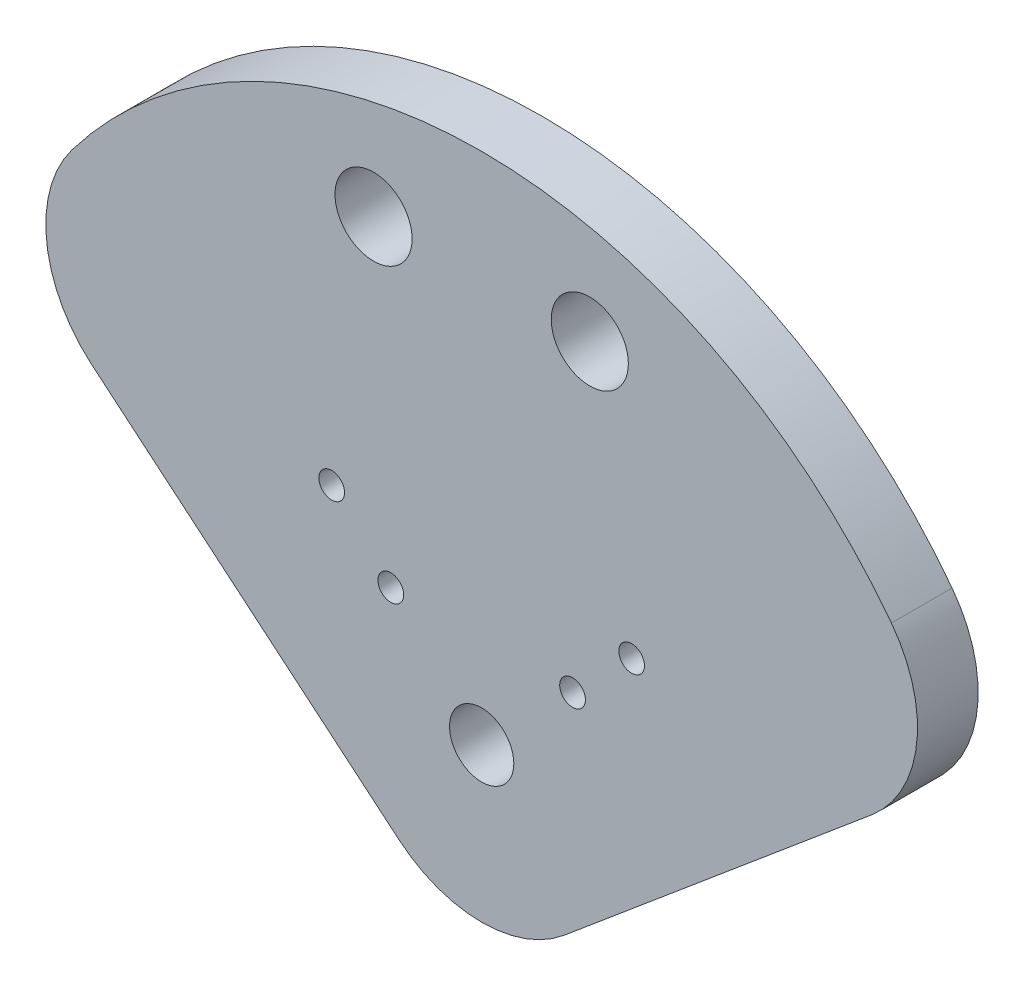
ISO-10303-21;
HEADER;
FILE_DESCRIPTION(('STEP AP214'),'2;1');
FILE_NAME('part.step','',(''),(''),'','','');
FILE_SCHEMA(('AUTOMOTIVE_DESIGN { 1 0 10303 214 1 1 1 1 }'));
ENDSEC;
DATA;
#1=APPLICATION_CONTEXT('core data for automotive mechanical design processes');
#2=APPLICATION_PROTOCOL_DEFINITION('international standard','automotive_design',2000,#1);
#3=PRODUCT_CONTEXT('',#1,'mechanical');
#4=PRODUCT('Part','Part','',(#3));
#5=PRODUCT_RELATED_PRODUCT_CATEGORY('part','',(#4));
#6=PRODUCT_DEFINITION_FORMATION('','',#4);
#7=PRODUCT_DEFINITION_CONTEXT('part definition',#1,'design');
#8=PRODUCT_DEFINITION('design','',#6,#7);
#9=PRODUCT_DEFINITION_SHAPE('','',#8);
#10=(LENGTH_UNIT() NAMED_UNIT(*) SI_UNIT(.MILLI.,.METRE.));
#11=(NAMED_UNIT(*) PLANE_ANGLE_UNIT() SI_UNIT($,.RADIAN.));
#12=(NAMED_UNIT(*) SI_UNIT($,.STERADIAN.) SOLID_ANGLE_UNIT());
#13=UNCERTAINTY_MEASURE_WITH_UNIT(LENGTH_MEASURE(1.E-05),#10,'distance_accuracy_value','');
#14=(GEOMETRIC_REPRESENTATION_CONTEXT(3) GLOBAL_UNCERTAINTY_ASSIGNED_CONTEXT((#13)) GLOBAL_UNIT_ASSIGNED_CONTEXT((#10,
#11,#12)) REPRESENTATION_CONTEXT('',''));
#15=CARTESIAN_POINT('',(0.,0.,0.));
#16=DIRECTION('',(0.,0.,1.));
#17=DIRECTION('',(1.,0.,0.));
#18=AXIS2_PLACEMENT_3D('',#15,#16,#17);
#19=CARTESIAN_POINT('',(0.,0.,5.9944));
#20=DIRECTION('',(0.,0.,1.));
#21=DIRECTION('',(1.,0.,0.));
#22=AXIS2_PLACEMENT_3D('',#19,#20,#21);
#23=PLANE('',#22);
#24=CARTESIAN_POINT('',(14.8174225997641,14.8174225997641,5.9944));
#25=DIRECTION('',(0.,0.,1.));
#26=DIRECTION('',(1.,0.,0.));
#27=AXIS2_PLACEMENT_3D('',#24,#25,#26);
#28=CIRCLE('',#27,1.27);
#29=CARTESIAN_POINT('',(16.0874225997641,14.8174225997641,5.9944));
#30=VERTEX_POINT('',#29);
#31=EDGE_CURVE('E175',#30,#30,#28,.T.);
#32=ORIENTED_EDGE('',*,*,#31,.F.);
#33=EDGE_LOOP('',(#32));
#34=FACE_BOUND('',#33,.T.);
#35=CARTESIAN_POINT('',(-8.98025612106911,8.9802561210692,5.9944));
#36=DIRECTION('',(0.,0.,1.));
#37=DIRECTION('',(1.,0.,0.));
#38=AXIS2_PLACEMENT_3D('',#35,#36,#37);
#39=CIRCLE('',#38,1.27);
#40=CARTESIAN_POINT('',(-7.71025612106911,8.9802561210692,5.9944));
#41=VERTEX_POINT('',#40);
#42=EDGE_CURVE('E163',#41,#41,#39,.T.);
#43=ORIENTED_EDGE('',*,*,#42,.F.);
#44=EDGE_LOOP('',(#43));
#45=FACE_BOUND('',#44,.T.);
#46=CARTESIAN_POINT('',(10.6827560866066,39.8685884800813,5.9944));
#47=DIRECTION('',(0.,0.,1.));
#48=DIRECTION('',(1.,0.,0.));
#49=AXIS2_PLACEMENT_3D('',#46,#47,#48);
#50=CIRCLE('',#49,3.80999999999999);
#51=CARTESIAN_POINT('',(14.4927560866066,39.8685884800813,5.9944));
#52=VERTEX_POINT('',#51);
#53=EDGE_CURVE('E151',#52,#52,#50,.T.);
#54=ORIENTED_EDGE('',*,*,#53,.F.);
#55=EDGE_LOOP('',(#54));
#56=FACE_BOUND('',#55,.T.);
#57=DIRECTION('',(0.766044443118977,-0.642787609686541,0.));
#58=VECTOR('',#57,1.);
#59=CARTESIAN_POINT('',(-46.6551070645943,20.0982831304378,5.9944));
#60=LINE('',#59,#58);
#61=CARTESIAN_POINT('',(-38.530534594115,13.2809573669855,5.9944));
#62=VERTEX_POINT('',#61);
#63=CARTESIAN_POINT('',(-8.16340264301907,-12.200091853091,5.9944));
#64=VERTEX_POINT('',#63);
#65=EDGE_CURVE('E99',#62,#64,#60,.T.);
#66=ORIENTED_EDGE('',*,*,#65,.T.);
#67=CARTESIAN_POINT('',(0.,-2.47132742548004,5.9944));
#68=DIRECTION('',(0.,0.,1.));
#69=DIRECTION('',(1.,0.,0.));
#70=AXIS2_PLACEMENT_3D('',#67,#68,#69);
#71=CIRCLE('',#70,12.7);
#72=CARTESIAN_POINT('',(8.16340264301907,-12.200091853091,5.9944));
#73=VERTEX_POINT('',#72);
#74=EDGE_CURVE('E11',#64,#73,#71,.T.);
#75=ORIENTED_EDGE('',*,*,#74,.T.);
#76=DIRECTION('',(0.766044443118977,0.642787609686541,0.));
#77=VECTOR('',#76,1.);
#78=CARTESIAN_POINT('',(0.,-19.05,5.9944));
#79=LINE('',#78,#77);
#80=CARTESIAN_POINT('',(38.530534594115,13.2809573669854,5.9944));
#81=VERTEX_POINT('',#80);
#82=EDGE_CURVE('E100',#73,#81,#79,.T.);
#83=ORIENTED_EDGE('',*,*,#82,.T.);
#84=CARTESIAN_POINT('',(30.367131951096,23.0097217945965,5.9944));
#85=DIRECTION('',(0.,0.,1.));
#86=DIRECTION('',(1.,0.,0.));
#87=AXIS2_PLACEMENT_3D('',#84,#85,#86);
#88=CIRCLE('',#87,12.7);
#89=CARTESIAN_POINT('',(40.4895092681279,30.6796290594619,5.9944));
#90=VERTEX_POINT('',#89);
#91=EDGE_CURVE('E118',#81,#90,#88,.T.);
#92=ORIENTED_EDGE('',*,*,#91,.T.);
#93=CARTESIAN_POINT('',(0.,0.,5.9944));
#94=DIRECTION('',(0.,0.,1.));
#95=DIRECTION('',(1.,0.,0.));
#96=AXIS2_PLACEMENT_3D('',#93,#94,#95);
#97=CIRCLE('',#96,50.8);
#98=CARTESIAN_POINT('',(-40.4895092681279,30.679629059462,5.9944));
#99=VERTEX_POINT('',#98);
#100=EDGE_CURVE('E107',#90,#99,#97,.T.);
#101=ORIENTED_EDGE('',*,*,#100,.T.);
#102=CARTESIAN_POINT('',(-30.3671319510959,23.0097217945965,5.9944));
#103=DIRECTION('',(0.,0.,1.));
#104=DIRECTION('',(1.,0.,0.));
#105=AXIS2_PLACEMENT_3D('',#102,#103,#104);
#106=CIRCLE('',#105,12.7);
#107=EDGE_CURVE('E120',#99,#62,#106,.T.);
#108=ORIENTED_EDGE('',*,*,#107,.T.);
#109=EDGE_LOOP('',(#66,#75,#83,#92,#101,#108));
#110=FACE_BOUND('',#109,.T.);
#111=CARTESIAN_POINT('',(-10.6827560866063,39.8685884800814,5.9944));
#112=DIRECTION('',(0.,0.,1.));
#113=DIRECTION('',(1.,0.,0.));
#114=AXIS2_PLACEMENT_3D('',#111,#112,#113);
#115=CIRCLE('',#114,3.81);
#116=CARTESIAN_POINT('',(-6.87275608660628,39.8685884800814,5.9944));
#117=VERTEX_POINT('',#116);
#118=EDGE_CURVE('E109',#117,#117,#115,.T.);
#119=ORIENTED_EDGE('',*,*,#118,.F.);
#120=EDGE_LOOP('',(#119));
#121=FACE_BOUND('',#120,.T.);
#122=CARTESIAN_POINT('',(-14.817422599764,14.8174225997642,5.9944));
#123=DIRECTION('',(0.,0.,1.));
#124=DIRECTION('',(1.,0.,0.));
#125=AXIS2_PLACEMENT_3D('',#122,#123,#124);
#126=CIRCLE('',#125,1.27);
#127=CARTESIAN_POINT('',(-13.547422599764,14.8174225997642,5.9944));
#128=VERTEX_POINT('',#127);
#129=EDGE_CURVE('E157',#128,#128,#126,.T.);
#130=ORIENTED_EDGE('',*,*,#129,.F.);
#131=EDGE_LOOP('',(#130));
#132=FACE_BOUND('',#131,.T.);
#133=CARTESIAN_POINT('',(8.98025612106917,8.98025612106914,5.9944));
#134=DIRECTION('',(0.,0.,1.));
#135=DIRECTION('',(1.,0.,0.));
#136=AXIS2_PLACEMENT_3D('',#133,#134,#135);
#137=CIRCLE('',#136,1.27);
#138=CARTESIAN_POINT('',(10.2502561210692,8.98025612106914,5.9944));
#139=VERTEX_POINT('',#138);
#140=EDGE_CURVE('E169',#139,#139,#137,.T.);
#141=ORIENTED_EDGE('',*,*,#140,.F.);
#142=EDGE_LOOP('',(#141));
#143=FACE_BOUND('',#142,.T.);
#144=CARTESIAN_POINT('',(0.,0.,5.9944));
#145=DIRECTION('',(0.,0.,1.));
#146=DIRECTION('',(1.,0.,0.));
#147=AXIS2_PLACEMENT_3D('',#144,#145,#146);
#148=CIRCLE('',#147,3.175);
#149=CARTESIAN_POINT('',(3.175,0.,5.9944));
#150=VERTEX_POINT('',#149);
#151=EDGE_CURVE('E181',#150,#150,#148,.T.);
#152=ORIENTED_EDGE('',*,*,#151,.F.);
#153=EDGE_LOOP('',(#152));
#154=FACE_BOUND('',#153,.T.);
#155=ADVANCED_FACE('F33',(#34,#45,#56,#110,#121,#132,#143,#154),#23,.T.);
#156=CARTESIAN_POINT('',(0.,0.,0.));
#157=DIRECTION('',(0.,0.,1.));
#158=DIRECTION('',(1.,0.,0.));
#159=AXIS2_PLACEMENT_3D('',#156,#157,#158);
#160=PLANE('',#159);
#161=CARTESIAN_POINT('',(14.8174225997641,14.8174225997641,0.));
#162=DIRECTION('',(0.,0.,1.));
#163=DIRECTION('',(1.,0.,0.));
#164=AXIS2_PLACEMENT_3D('',#161,#162,#163);
#165=CIRCLE('',#164,1.27);
#166=CARTESIAN_POINT('',(16.0874225997641,14.8174225997641,0.));
#167=VERTEX_POINT('',#166);
#168=EDGE_CURVE('E178',#167,#167,#165,.T.);
#169=ORIENTED_EDGE('',*,*,#168,.T.);
#170=EDGE_LOOP('',(#169));
#171=FACE_BOUND('',#170,.T.);
#172=CARTESIAN_POINT('',(-8.98025612106911,8.9802561210692,0.));
#173=DIRECTION('',(0.,0.,1.));
#174=DIRECTION('',(1.,0.,0.));
#175=AXIS2_PLACEMENT_3D('',#172,#173,#174);
#176=CIRCLE('',#175,1.27);
#177=CARTESIAN_POINT('',(-7.71025612106911,8.9802561210692,0.));
#178=VERTEX_POINT('',#177);
#179=EDGE_CURVE('E166',#178,#178,#176,.T.);
#180=ORIENTED_EDGE('',*,*,#179,.T.);
#181=EDGE_LOOP('',(#180));
#182=FACE_BOUND('',#181,.T.);
#183=CARTESIAN_POINT('',(10.6827560866066,39.8685884800813,0.));
#184=DIRECTION('',(0.,0.,1.));
#185=DIRECTION('',(1.,0.,0.));
#186=AXIS2_PLACEMENT_3D('',#183,#184,#185);
#187=CIRCLE('',#186,3.80999999999999);
#188=CARTESIAN_POINT('',(14.4927560866066,39.8685884800813,0.));
#189=VERTEX_POINT('',#188);
#190=EDGE_CURVE('E154',#189,#189,#187,.T.);
#191=ORIENTED_EDGE('',*,*,#190,.T.);
#192=EDGE_LOOP('',(#191));
#193=FACE_BOUND('',#192,.T.);
#194=DIRECTION('',(0.766044443118977,0.642787609686541,0.));
#195=VECTOR('',#194,1.);
#196=CARTESIAN_POINT('',(0.,-19.05,0.));
#197=LINE('',#196,#195);
#198=CARTESIAN_POINT('',(8.16340264301907,-12.200091853091,0.));
#199=VERTEX_POINT('',#198);
#200=CARTESIAN_POINT('',(38.530534594115,13.2809573669854,0.));
#201=VERTEX_POINT('',#200);
#202=EDGE_CURVE('E104',#199,#201,#197,.T.);
#203=ORIENTED_EDGE('',*,*,#202,.F.);
#204=CARTESIAN_POINT('',(0.,-2.47132742548004,0.));
#205=DIRECTION('',(0.,0.,1.));
#206=DIRECTION('',(1.,0.,0.));
#207=AXIS2_PLACEMENT_3D('',#204,#205,#206);
#208=CIRCLE('',#207,12.7);
#209=CARTESIAN_POINT('',(-8.16340264301907,-12.200091853091,0.));
#210=VERTEX_POINT('',#209);
#211=EDGE_CURVE('E55',#199,#210,#208,.F.);
#212=ORIENTED_EDGE('',*,*,#211,.T.);
#213=DIRECTION('',(0.766044443118977,-0.642787609686541,0.));
#214=VECTOR('',#213,1.);
#215=CARTESIAN_POINT('',(-46.6551070645943,20.0982831304378,0.));
#216=LINE('',#215,#214);
#217=CARTESIAN_POINT('',(-38.530534594115,13.2809573669855,0.));
#218=VERTEX_POINT('',#217);
#219=EDGE_CURVE('E98',#218,#210,#216,.T.);
#220=ORIENTED_EDGE('',*,*,#219,.F.);
#221=CARTESIAN_POINT('',(-30.3671319510959,23.0097217945965,0.));
#222=DIRECTION('',(0.,0.,1.));
#223=DIRECTION('',(1.,0.,0.));
#224=AXIS2_PLACEMENT_3D('',#221,#222,#223);
#225=CIRCLE('',#224,12.7);
#226=CARTESIAN_POINT('',(-40.4895092681279,30.679629059462,0.));
#227=VERTEX_POINT('',#226);
#228=EDGE_CURVE('E86',#218,#227,#225,.F.);
#229=ORIENTED_EDGE('',*,*,#228,.T.);
#230=CARTESIAN_POINT('',(0.,0.,0.));
#231=DIRECTION('',(0.,0.,1.));
#232=DIRECTION('',(1.,0.,0.));
#233=AXIS2_PLACEMENT_3D('',#230,#231,#232);
#234=CIRCLE('',#233,50.8);
#235=CARTESIAN_POINT('',(40.4895092681279,30.6796290594619,0.));
#236=VERTEX_POINT('',#235);
#237=EDGE_CURVE('E105',#236,#227,#234,.T.);
#238=ORIENTED_EDGE('',*,*,#237,.F.);
#239=CARTESIAN_POINT('',(30.367131951096,23.0097217945965,0.));
#240=DIRECTION('',(0.,0.,1.));
#241=DIRECTION('',(1.,0.,0.));
#242=AXIS2_PLACEMENT_3D('',#239,#240,#241);
#243=CIRCLE('',#242,12.7);
#244=EDGE_CURVE('E95',#236,#201,#243,.F.);
#245=ORIENTED_EDGE('',*,*,#244,.T.);
#246=EDGE_LOOP('',(#203,#212,#220,#229,#238,#245));
#247=FACE_BOUND('',#246,.T.);
#248=CARTESIAN_POINT('',(-10.6827560866063,39.8685884800814,0.));
#249=DIRECTION('',(0.,0.,1.));
#250=DIRECTION('',(1.,0.,0.));
#251=AXIS2_PLACEMENT_3D('',#248,#249,#250);
#252=CIRCLE('',#251,3.81);
#253=CARTESIAN_POINT('',(-6.87275608660628,39.8685884800814,0.));
#254=VERTEX_POINT('',#253);
#255=EDGE_CURVE('E148',#254,#254,#252,.T.);
#256=ORIENTED_EDGE('',*,*,#255,.T.);
#257=EDGE_LOOP('',(#256));
#258=FACE_BOUND('',#257,.T.);
#259=CARTESIAN_POINT('',(-14.817422599764,14.8174225997642,0.));
#260=DIRECTION('',(0.,0.,1.));
#261=DIRECTION('',(1.,0.,0.));
#262=AXIS2_PLACEMENT_3D('',#259,#260,#261);
#263=CIRCLE('',#262,1.27);
#264=CARTESIAN_POINT('',(-13.547422599764,14.8174225997642,0.));
#265=VERTEX_POINT('',#264);
#266=EDGE_CURVE('E160',#265,#265,#263,.T.);
#267=ORIENTED_EDGE('',*,*,#266,.T.);
#268=EDGE_LOOP('',(#267));
#269=FACE_BOUND('',#268,.T.);
#270=CARTESIAN_POINT('',(8.98025612106917,8.98025612106914,0.));
#271=DIRECTION('',(0.,0.,1.));
#272=DIRECTION('',(1.,0.,0.));
#273=AXIS2_PLACEMENT_3D('',#270,#271,#272);
#274=CIRCLE('',#273,1.27);
#275=CARTESIAN_POINT('',(10.2502561210692,8.98025612106914,0.));
#276=VERTEX_POINT('',#275);
#277=EDGE_CURVE('E172',#276,#276,#274,.T.);
#278=ORIENTED_EDGE('',*,*,#277,.T.);
#279=EDGE_LOOP('',(#278));
#280=FACE_BOUND('',#279,.T.);
#281=CARTESIAN_POINT('',(0.,0.,0.));
#282=DIRECTION('',(0.,0.,1.));
#283=DIRECTION('',(1.,0.,0.));
#284=AXIS2_PLACEMENT_3D('',#281,#282,#283);
#285=CIRCLE('',#284,3.175);
#286=CARTESIAN_POINT('',(3.175,0.,0.));
#287=VERTEX_POINT('',#286);
#288=EDGE_CURVE('E184',#287,#287,#285,.T.);
#289=ORIENTED_EDGE('',*,*,#288,.T.);
#290=EDGE_LOOP('',(#289));
#291=FACE_BOUND('',#290,.T.);
#292=ADVANCED_FACE('F102',(#171,#182,#193,#247,#258,#269,#280,#291),#160,.F.);
#293=CARTESIAN_POINT('',(0.,0.,5.9944));
#294=DIRECTION('',(0.,0.,-1.));
#295=DIRECTION('',(-1.,0.,0.));
#296=AXIS2_PLACEMENT_3D('',#293,#294,#295);
#297=CYLINDRICAL_SURFACE('',#296,50.8);
#298=ORIENTED_EDGE('',*,*,#237,.T.);
#299=DIRECTION('',(0.,0.,-1.));
#300=VECTOR('',#299,1.);
#301=CARTESIAN_POINT('',(-40.4895092681279,30.679629059462,5.9944));
#302=LINE('',#301,#300);
#303=EDGE_CURVE('E91',#227,#99,#302,.F.);
#304=ORIENTED_EDGE('',*,*,#303,.T.);
#305=ORIENTED_EDGE('',*,*,#100,.F.);
#306=DIRECTION('',(0.,0.,-1.));
#307=VECTOR('',#306,1.);
#308=CARTESIAN_POINT('',(40.4895092681279,30.6796290594619,5.9944));
#309=LINE('',#308,#307);
#310=EDGE_CURVE('E94',#90,#236,#309,.T.);
#311=ORIENTED_EDGE('',*,*,#310,.T.);
#312=EDGE_LOOP('',(#298,#304,#305,#311));
#313=FACE_BOUND('',#312,.T.);
#314=ADVANCED_FACE('F144',(#313),#297,.T.);
#315=CARTESIAN_POINT('',(-46.6551070645943,20.0982831304378,5.9944));
#316=DIRECTION('',(0.642787609686541,0.766044443118977,0.));
#317=DIRECTION('',(-0.766044443118977,0.642787609686541,0.));
#318=AXIS2_PLACEMENT_3D('',#315,#316,#317);
#319=PLANE('',#318);
#320=ORIENTED_EDGE('',*,*,#219,.T.);
#321=DIRECTION('',(0.,0.,-1.));
#322=VECTOR('',#321,1.);
#323=CARTESIAN_POINT('',(-8.16340264301907,-12.200091853091,5.9944));
#324=LINE('',#323,#322);
#325=EDGE_CURVE('E41',#210,#64,#324,.F.);
#326=ORIENTED_EDGE('',*,*,#325,.T.);
#327=ORIENTED_EDGE('',*,*,#65,.F.);
#328=DIRECTION('',(0.,0.,-1.));
#329=VECTOR('',#328,1.);
#330=CARTESIAN_POINT('',(-38.530534594115,13.2809573669855,5.9944));
#331=LINE('',#330,#329);
#332=EDGE_CURVE('E90',#62,#218,#331,.T.);
#333=ORIENTED_EDGE('',*,*,#332,.T.);
#334=EDGE_LOOP('',(#320,#326,#327,#333));
#335=FACE_BOUND('',#334,.T.);
#336=ADVANCED_FACE('F97',(#335),#319,.F.);
#337=CARTESIAN_POINT('',(0.,-19.05,5.9944));
#338=DIRECTION('',(-0.642787609686541,0.766044443118977,0.));
#339=DIRECTION('',(-0.766044443118977,-0.642787609686541,0.));
#340=AXIS2_PLACEMENT_3D('',#337,#338,#339);
#341=PLANE('',#340);
#342=ORIENTED_EDGE('',*,*,#82,.F.);
#343=DIRECTION('',(0.,0.,-1.));
#344=VECTOR('',#343,1.);
#345=CARTESIAN_POINT('',(8.16340264301907,-12.200091853091,5.9944));
#346=LINE('',#345,#344);
#347=EDGE_CURVE('E125',#73,#199,#346,.T.);
#348=ORIENTED_EDGE('',*,*,#347,.T.);
#349=ORIENTED_EDGE('',*,*,#202,.T.);
#350=DIRECTION('',(0.,0.,-1.));
#351=VECTOR('',#350,1.);
#352=CARTESIAN_POINT('',(38.530534594115,13.2809573669854,5.9944));
#353=LINE('',#352,#351);
#354=EDGE_CURVE('E122',#201,#81,#353,.F.);
#355=ORIENTED_EDGE('',*,*,#354,.T.);
#356=EDGE_LOOP('',(#342,#348,#349,#355));
#357=FACE_BOUND('',#356,.T.);
#358=ADVANCED_FACE('F131',(#357),#341,.F.);
#359=CARTESIAN_POINT('',(-10.6827560866063,39.8685884800814,5.9944));
#360=DIRECTION('',(0.,0.,-1.));
#361=DIRECTION('',(-1.,0.,0.));
#362=AXIS2_PLACEMENT_3D('',#359,#360,#361);
#363=CYLINDRICAL_SURFACE('',#362,3.81);
#364=ORIENTED_EDGE('',*,*,#118,.T.);
#365=EDGE_LOOP('',(#364));
#366=FACE_BOUND('',#365,.T.);
#367=ORIENTED_EDGE('',*,*,#255,.F.);
#368=EDGE_LOOP('',(#367));
#369=FACE_BOUND('',#368,.T.);
#370=ADVANCED_FACE('F204',(#366,#369),#363,.F.);
#371=CARTESIAN_POINT('',(10.6827560866066,39.8685884800813,5.9944));
#372=DIRECTION('',(0.,0.,-1.));
#373=DIRECTION('',(-1.,0.,0.));
#374=AXIS2_PLACEMENT_3D('',#371,#372,#373);
#375=CYLINDRICAL_SURFACE('',#374,3.80999999999999);
#376=ORIENTED_EDGE('',*,*,#53,.T.);
#377=EDGE_LOOP('',(#376));
#378=FACE_BOUND('',#377,.T.);
#379=ORIENTED_EDGE('',*,*,#190,.F.);
#380=EDGE_LOOP('',(#379));
#381=FACE_BOUND('',#380,.T.);
#382=ADVANCED_FACE('F308',(#378,#381),#375,.F.);
#383=CARTESIAN_POINT('',(-14.817422599764,14.8174225997642,5.9944));
#384=DIRECTION('',(0.,0.,-1.));
#385=DIRECTION('',(-1.,0.,0.));
#386=AXIS2_PLACEMENT_3D('',#383,#384,#385);
#387=CYLINDRICAL_SURFACE('',#386,1.27);
#388=ORIENTED_EDGE('',*,*,#129,.T.);
#389=EDGE_LOOP('',(#388));
#390=FACE_BOUND('',#389,.T.);
#391=ORIENTED_EDGE('',*,*,#266,.F.);
#392=EDGE_LOOP('',(#391));
#393=FACE_BOUND('',#392,.T.);
#394=ADVANCED_FACE('F298',(#390,#393),#387,.F.);
#395=CARTESIAN_POINT('',(-8.98025612106911,8.9802561210692,5.9944));
#396=DIRECTION('',(0.,0.,-1.));
#397=DIRECTION('',(-1.,0.,0.));
#398=AXIS2_PLACEMENT_3D('',#395,#396,#397);
#399=CYLINDRICAL_SURFACE('',#398,1.27);
#400=ORIENTED_EDGE('',*,*,#42,.T.);
#401=EDGE_LOOP('',(#400));
#402=FACE_BOUND('',#401,.T.);
#403=ORIENTED_EDGE('',*,*,#179,.F.);
#404=EDGE_LOOP('',(#403));
#405=FACE_BOUND('',#404,.T.);
#406=ADVANCED_FACE('F288',(#402,#405),#399,.F.);
#407=CARTESIAN_POINT('',(8.98025612106917,8.98025612106914,5.9944));
#408=DIRECTION('',(0.,0.,-1.));
#409=DIRECTION('',(-1.,0.,0.));
#410=AXIS2_PLACEMENT_3D('',#407,#408,#409);
#411=CYLINDRICAL_SURFACE('',#410,1.27);
#412=ORIENTED_EDGE('',*,*,#140,.T.);
#413=EDGE_LOOP('',(#412));
#414=FACE_BOUND('',#413,.T.);
#415=ORIENTED_EDGE('',*,*,#277,.F.);
#416=EDGE_LOOP('',(#415));
#417=FACE_BOUND('',#416,.T.);
#418=ADVANCED_FACE('F278',(#414,#417),#411,.F.);
#419=CARTESIAN_POINT('',(14.8174225997641,14.8174225997641,5.9944));
#420=DIRECTION('',(0.,0.,-1.));
#421=DIRECTION('',(-1.,0.,0.));
#422=AXIS2_PLACEMENT_3D('',#419,#420,#421);
#423=CYLINDRICAL_SURFACE('',#422,1.27);
#424=ORIENTED_EDGE('',*,*,#31,.T.);
#425=EDGE_LOOP('',(#424));
#426=FACE_BOUND('',#425,.T.);
#427=ORIENTED_EDGE('',*,*,#168,.F.);
#428=EDGE_LOOP('',(#427));
#429=FACE_BOUND('',#428,.T.);
#430=ADVANCED_FACE('F269',(#426,#429),#423,.F.);
#431=CARTESIAN_POINT('',(0.,0.,5.9944));
#432=DIRECTION('',(0.,0.,-1.));
#433=DIRECTION('',(-1.,0.,0.));
#434=AXIS2_PLACEMENT_3D('',#431,#432,#433);
#435=CYLINDRICAL_SURFACE('',#434,3.175);
#436=ORIENTED_EDGE('',*,*,#151,.T.);
#437=EDGE_LOOP('',(#436));
#438=FACE_BOUND('',#437,.T.);
#439=ORIENTED_EDGE('',*,*,#288,.F.);
#440=EDGE_LOOP('',(#439));
#441=FACE_BOUND('',#440,.T.);
#442=ADVANCED_FACE('F190',(#438,#441),#435,.F.);
#443=CARTESIAN_POINT('',(-30.3671319510959,23.0097217945965,5.9944));
#444=DIRECTION('',(0.,0.,-1.));
#445=DIRECTION('',(-1.,0.,0.));
#446=AXIS2_PLACEMENT_3D('',#443,#444,#445);
#447=CYLINDRICAL_SURFACE('',#446,12.7);
#448=ORIENTED_EDGE('',*,*,#107,.F.);
#449=ORIENTED_EDGE('',*,*,#303,.F.);
#450=ORIENTED_EDGE('',*,*,#228,.F.);
#451=ORIENTED_EDGE('',*,*,#332,.F.);
#452=EDGE_LOOP('',(#448,#449,#450,#451));
#453=FACE_BOUND('',#452,.T.);
#454=ADVANCED_FACE('F89',(#453),#447,.T.);
#455=CARTESIAN_POINT('',(30.367131951096,23.0097217945965,5.9944));
#456=DIRECTION('',(0.,0.,-1.));
#457=DIRECTION('',(-1.,0.,0.));
#458=AXIS2_PLACEMENT_3D('',#455,#456,#457);
#459=CYLINDRICAL_SURFACE('',#458,12.7);
#460=ORIENTED_EDGE('',*,*,#91,.F.);
#461=ORIENTED_EDGE('',*,*,#354,.F.);
#462=ORIENTED_EDGE('',*,*,#244,.F.);
#463=ORIENTED_EDGE('',*,*,#310,.F.);
#464=EDGE_LOOP('',(#460,#461,#462,#463));
#465=FACE_BOUND('',#464,.T.);
#466=ADVANCED_FACE('F138',(#465),#459,.T.);
#467=CARTESIAN_POINT('',(0.,-2.47132742548004,5.9944));
#468=DIRECTION('',(0.,0.,-1.));
#469=DIRECTION('',(-1.,0.,0.));
#470=AXIS2_PLACEMENT_3D('',#467,#468,#469);
#471=CYLINDRICAL_SURFACE('',#470,12.7);
#472=ORIENTED_EDGE('',*,*,#74,.F.);
#473=ORIENTED_EDGE('',*,*,#325,.F.);
#474=ORIENTED_EDGE('',*,*,#211,.F.);
#475=ORIENTED_EDGE('',*,*,#347,.F.);
#476=EDGE_LOOP('',(#472,#473,#474,#475));
#477=FACE_BOUND('',#476,.T.);
#478=ADVANCED_FACE('F35',(#477),#471,.T.);
#479=CLOSED_SHELL('',(#155,#292,#314,#336,#358,#370,#382,#394,#406,#418,#430,#442,#454,#466,#478));
#480=MANIFOLD_SOLID_BREP('B2',#479);
#481=ADVANCED_BREP_SHAPE_REPRESENTATION('',(#18,#480),#14);
#482=SHAPE_DEFINITION_REPRESENTATION(#9,#481);
ENDSEC;
END-ISO-10303-21;
